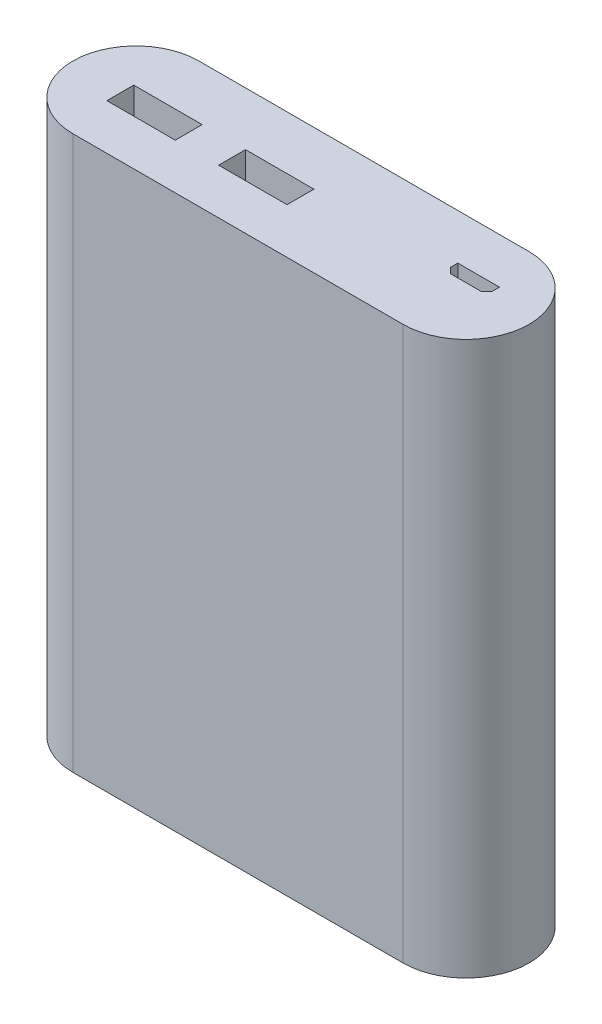
ISO-10303-21;
HEADER;
FILE_DESCRIPTION(('STEP AP214'),'2;1');
FILE_NAME('part.step','',(''),(''),'','','');
FILE_SCHEMA(('AUTOMOTIVE_DESIGN { 1 0 10303 214 1 1 1 1 }'));
ENDSEC;
DATA;
#1=APPLICATION_CONTEXT('core data for automotive mechanical design processes');
#2=APPLICATION_PROTOCOL_DEFINITION('international standard','automotive_design',2000,#1);
#3=PRODUCT_CONTEXT('',#1,'mechanical');
#4=PRODUCT('Part','Part','',(#3));
#5=PRODUCT_RELATED_PRODUCT_CATEGORY('part','',(#4));
#6=PRODUCT_DEFINITION_FORMATION('','',#4);
#7=PRODUCT_DEFINITION_CONTEXT('part definition',#1,'design');
#8=PRODUCT_DEFINITION('design','',#6,#7);
#9=PRODUCT_DEFINITION_SHAPE('','',#8);
#10=(LENGTH_UNIT() NAMED_UNIT(*) SI_UNIT(.MILLI.,.METRE.));
#11=(NAMED_UNIT(*) PLANE_ANGLE_UNIT() SI_UNIT($,.RADIAN.));
#12=(NAMED_UNIT(*) SI_UNIT($,.STERADIAN.) SOLID_ANGLE_UNIT());
#13=UNCERTAINTY_MEASURE_WITH_UNIT(LENGTH_MEASURE(1.E-05),#10,'distance_accuracy_value','');
#14=(GEOMETRIC_REPRESENTATION_CONTEXT(3) GLOBAL_UNCERTAINTY_ASSIGNED_CONTEXT((#13)) GLOBAL_UNIT_ASSIGNED_CONTEXT((#10,
#11,#12)) REPRESENTATION_CONTEXT('',''));
#15=CARTESIAN_POINT('',(0.,0.,0.));
#16=DIRECTION('',(0.,0.,1.));
#17=DIRECTION('',(1.,0.,0.));
#18=AXIS2_PLACEMENT_3D('',#15,#16,#17);
#19=CARTESIAN_POINT('',(-28.95,97.,0.));
#20=DIRECTION('',(0.,-1.,0.));
#21=DIRECTION('',(0.,0.,-1.));
#22=AXIS2_PLACEMENT_3D('',#19,#20,#21);
#23=CYLINDRICAL_SURFACE('',#22,11.05);
#24=CARTESIAN_POINT('',(-28.95,0.,0.));
#25=DIRECTION('',(0.,1.,0.));
#26=DIRECTION('',(0.,0.,1.));
#27=AXIS2_PLACEMENT_3D('',#24,#25,#26);
#28=CIRCLE('',#27,11.05);
#29=CARTESIAN_POINT('',(-28.95,0.,-11.05));
#30=VERTEX_POINT('',#29);
#31=CARTESIAN_POINT('',(-28.95,0.,11.05));
#32=VERTEX_POINT('',#31);
#33=EDGE_CURVE('E196',#30,#32,#28,.T.);
#34=ORIENTED_EDGE('',*,*,#33,.T.);
#35=DIRECTION('',(0.,-1.,0.));
#36=VECTOR('',#35,1.);
#37=CARTESIAN_POINT('',(-28.95,97.,11.05));
#38=LINE('',#37,#36);
#39=CARTESIAN_POINT('',(-28.95,97.,11.05));
#40=VERTEX_POINT('',#39);
#41=EDGE_CURVE('E11',#40,#32,#38,.T.);
#42=ORIENTED_EDGE('',*,*,#41,.F.);
#43=CARTESIAN_POINT('',(-28.95,97.,0.));
#44=DIRECTION('',(0.,1.,0.));
#45=DIRECTION('',(0.,0.,1.));
#46=AXIS2_PLACEMENT_3D('',#43,#44,#45);
#47=CIRCLE('',#46,11.05);
#48=CARTESIAN_POINT('',(-28.95,97.,-11.05));
#49=VERTEX_POINT('',#48);
#50=EDGE_CURVE('E277',#49,#40,#47,.T.);
#51=ORIENTED_EDGE('',*,*,#50,.F.);
#52=DIRECTION('',(0.,-1.,0.));
#53=VECTOR('',#52,1.);
#54=CARTESIAN_POINT('',(-28.95,97.,-11.05));
#55=LINE('',#54,#53);
#56=EDGE_CURVE('E287',#49,#30,#55,.T.);
#57=ORIENTED_EDGE('',*,*,#56,.T.);
#58=EDGE_LOOP('',(#34,#42,#51,#57));
#59=FACE_BOUND('',#58,.T.);
#60=ADVANCED_FACE('F36',(#59),#23,.T.);
#61=CARTESIAN_POINT('',(-28.95,97.,11.05));
#62=DIRECTION('',(0.,0.,-1.));
#63=DIRECTION('',(-1.,0.,0.));
#64=AXIS2_PLACEMENT_3D('',#61,#62,#63);
#65=PLANE('',#64);
#66=DIRECTION('',(1.,0.,0.));
#67=VECTOR('',#66,1.);
#68=CARTESIAN_POINT('',(-28.95,0.,11.05));
#69=LINE('',#68,#67);
#70=CARTESIAN_POINT('',(28.95,0.,11.05));
#71=VERTEX_POINT('',#70);
#72=EDGE_CURVE('E290',#32,#71,#69,.T.);
#73=ORIENTED_EDGE('',*,*,#72,.T.);
#74=DIRECTION('',(0.,-1.,0.));
#75=VECTOR('',#74,1.);
#76=CARTESIAN_POINT('',(28.95,97.,11.05));
#77=LINE('',#76,#75);
#78=CARTESIAN_POINT('',(28.95,97.,11.05));
#79=VERTEX_POINT('',#78);
#80=EDGE_CURVE('E43',#79,#71,#77,.T.);
#81=ORIENTED_EDGE('',*,*,#80,.F.);
#82=DIRECTION('',(1.,0.,0.));
#83=VECTOR('',#82,1.);
#84=CARTESIAN_POINT('',(-28.95,97.,11.05));
#85=LINE('',#84,#83);
#86=EDGE_CURVE('E280',#40,#79,#85,.T.);
#87=ORIENTED_EDGE('',*,*,#86,.F.);
#88=ORIENTED_EDGE('',*,*,#41,.T.);
#89=EDGE_LOOP('',(#73,#81,#87,#88));
#90=FACE_BOUND('',#89,.T.);
#91=ADVANCED_FACE('F320',(#90),#65,.F.);
#92=CARTESIAN_POINT('',(28.95,97.,0.));
#93=DIRECTION('',(0.,-1.,0.));
#94=DIRECTION('',(0.,0.,-1.));
#95=AXIS2_PLACEMENT_3D('',#92,#93,#94);
#96=CYLINDRICAL_SURFACE('',#95,11.05);
#97=CARTESIAN_POINT('',(28.95,0.,0.));
#98=DIRECTION('',(0.,1.,0.));
#99=DIRECTION('',(0.,0.,1.));
#100=AXIS2_PLACEMENT_3D('',#97,#98,#99);
#101=CIRCLE('',#100,11.05);
#102=CARTESIAN_POINT('',(28.95,0.,-11.05));
#103=VERTEX_POINT('',#102);
#104=EDGE_CURVE('E292',#71,#103,#101,.T.);
#105=ORIENTED_EDGE('',*,*,#104,.T.);
#106=DIRECTION('',(0.,-1.,0.));
#107=VECTOR('',#106,1.);
#108=CARTESIAN_POINT('',(28.95,97.,-11.05));
#109=LINE('',#108,#107);
#110=CARTESIAN_POINT('',(28.95,97.,-11.05));
#111=VERTEX_POINT('',#110);
#112=EDGE_CURVE('E297',#111,#103,#109,.T.);
#113=ORIENTED_EDGE('',*,*,#112,.F.);
#114=CARTESIAN_POINT('',(28.95,97.,0.));
#115=DIRECTION('',(0.,1.,0.));
#116=DIRECTION('',(0.,0.,1.));
#117=AXIS2_PLACEMENT_3D('',#114,#115,#116);
#118=CIRCLE('',#117,11.05);
#119=EDGE_CURVE('E283',#79,#111,#118,.T.);
#120=ORIENTED_EDGE('',*,*,#119,.F.);
#121=ORIENTED_EDGE('',*,*,#80,.T.);
#122=EDGE_LOOP('',(#105,#113,#120,#121));
#123=FACE_BOUND('',#122,.T.);
#124=ADVANCED_FACE('F304',(#123),#96,.T.);
#125=CARTESIAN_POINT('',(-28.95,97.,-11.05));
#126=DIRECTION('',(0.,0.,1.));
#127=DIRECTION('',(1.,0.,0.));
#128=AXIS2_PLACEMENT_3D('',#125,#126,#127);
#129=PLANE('',#128);
#130=DIRECTION('',(-1.,0.,0.));
#131=VECTOR('',#130,1.);
#132=CARTESIAN_POINT('',(-28.95,0.,-11.05));
#133=LINE('',#132,#131);
#134=EDGE_CURVE('E281',#103,#30,#133,.T.);
#135=ORIENTED_EDGE('',*,*,#134,.T.);
#136=ORIENTED_EDGE('',*,*,#56,.F.);
#137=DIRECTION('',(-1.,0.,0.));
#138=VECTOR('',#137,1.);
#139=CARTESIAN_POINT('',(-28.95,97.,-11.05));
#140=LINE('',#139,#138);
#141=EDGE_CURVE('E285',#111,#49,#140,.T.);
#142=ORIENTED_EDGE('',*,*,#141,.F.);
#143=ORIENTED_EDGE('',*,*,#112,.T.);
#144=EDGE_LOOP('',(#135,#136,#142,#143));
#145=FACE_BOUND('',#144,.T.);
#146=ADVANCED_FACE('F313',(#145),#129,.F.);
#147=CARTESIAN_POINT('',(-28.95,97.,0.));
#148=DIRECTION('',(0.,1.,0.));
#149=DIRECTION('',(0.,0.,1.));
#150=AXIS2_PLACEMENT_3D('',#147,#148,#149);
#151=PLANE('',#150);
#152=DIRECTION('',(0.,0.,-1.));
#153=VECTOR('',#152,1.);
#154=CARTESIAN_POINT('',(-19.,97.,-1.67));
#155=LINE('',#154,#153);
#156=CARTESIAN_POINT('',(-19.,97.,3.05));
#157=VERTEX_POINT('',#156);
#158=CARTESIAN_POINT('',(-19.,97.,-1.67));
#159=VERTEX_POINT('',#158);
#160=EDGE_CURVE('E50',#157,#159,#155,.T.);
#161=ORIENTED_EDGE('',*,*,#160,.F.);
#162=DIRECTION('',(1.,0.,0.));
#163=VECTOR('',#162,1.);
#164=CARTESIAN_POINT('',(-31.,97.,3.05));
#165=LINE('',#164,#163);
#166=CARTESIAN_POINT('',(-31.,97.,3.05));
#167=VERTEX_POINT('',#166);
#168=EDGE_CURVE('E180',#167,#157,#165,.T.);
#169=ORIENTED_EDGE('',*,*,#168,.F.);
#170=DIRECTION('',(0.,0.,1.));
#171=VECTOR('',#170,1.);
#172=CARTESIAN_POINT('',(-31.,97.,-1.67));
#173=LINE('',#172,#171);
#174=CARTESIAN_POINT('',(-31.,97.,-1.67));
#175=VERTEX_POINT('',#174);
#176=EDGE_CURVE('E183',#175,#167,#173,.T.);
#177=ORIENTED_EDGE('',*,*,#176,.F.);
#178=DIRECTION('',(-1.,0.,0.));
#179=VECTOR('',#178,1.);
#180=CARTESIAN_POINT('',(-31.,97.,-1.67));
#181=LINE('',#180,#179);
#182=EDGE_CURVE('E189',#159,#175,#181,.T.);
#183=ORIENTED_EDGE('',*,*,#182,.F.);
#184=EDGE_LOOP('',(#161,#169,#177,#183));
#185=FACE_BOUND('',#184,.T.);
#186=DIRECTION('',(1.,0.,0.));
#187=VECTOR('',#186,1.);
#188=CARTESIAN_POINT('',(-11.4,97.,3.05));
#189=LINE('',#188,#187);
#190=CARTESIAN_POINT('',(-11.4,97.,3.05));
#191=VERTEX_POINT('',#190);
#192=CARTESIAN_POINT('',(0.599999999999986,97.,3.05));
#193=VERTEX_POINT('',#192);
#194=EDGE_CURVE('E58',#191,#193,#189,.T.);
#195=ORIENTED_EDGE('',*,*,#194,.F.);
#196=DIRECTION('',(0.,0.,1.));
#197=VECTOR('',#196,1.);
#198=CARTESIAN_POINT('',(-11.4,97.,-1.67));
#199=LINE('',#198,#197);
#200=CARTESIAN_POINT('',(-11.4,97.,-1.67));
#201=VERTEX_POINT('',#200);
#202=EDGE_CURVE('E204',#201,#191,#199,.T.);
#203=ORIENTED_EDGE('',*,*,#202,.F.);
#204=DIRECTION('',(-1.,0.,0.));
#205=VECTOR('',#204,1.);
#206=CARTESIAN_POINT('',(-11.4,97.,-1.67));
#207=LINE('',#206,#205);
#208=CARTESIAN_POINT('',(0.599999999999986,97.,-1.67));
#209=VERTEX_POINT('',#208);
#210=EDGE_CURVE('E219',#209,#201,#207,.T.);
#211=ORIENTED_EDGE('',*,*,#210,.F.);
#212=DIRECTION('',(0.,0.,-1.));
#213=VECTOR('',#212,1.);
#214=CARTESIAN_POINT('',(0.599999999999986,97.,-1.67));
#215=LINE('',#214,#213);
#216=EDGE_CURVE('E215',#193,#209,#215,.T.);
#217=ORIENTED_EDGE('',*,*,#216,.F.);
#218=EDGE_LOOP('',(#195,#203,#211,#217));
#219=FACE_BOUND('',#218,.T.);
#220=DIRECTION('',(0.,0.,-1.));
#221=VECTOR('',#220,1.);
#222=CARTESIAN_POINT('',(31.75,97.,-3.05));
#223=LINE('',#222,#221);
#224=CARTESIAN_POINT('',(31.75,97.,-1.8));
#225=VERTEX_POINT('',#224);
#226=CARTESIAN_POINT('',(31.75,97.,-3.05));
#227=VERTEX_POINT('',#226);
#228=EDGE_CURVE('E250',#225,#227,#223,.T.);
#229=ORIENTED_EDGE('',*,*,#228,.F.);
#230=DIRECTION('',(0.707106781186548,0.,-0.707106781186547));
#231=VECTOR('',#230,1.);
#232=CARTESIAN_POINT('',(31.75,97.,-1.8));
#233=LINE('',#232,#231);
#234=CARTESIAN_POINT('',(30.75,97.,-0.8));
#235=VERTEX_POINT('',#234);
#236=EDGE_CURVE('E234',#235,#225,#233,.T.);
#237=ORIENTED_EDGE('',*,*,#236,.F.);
#238=DIRECTION('',(1.,0.,0.));
#239=VECTOR('',#238,1.);
#240=CARTESIAN_POINT('',(30.75,97.,-0.8));
#241=LINE('',#240,#239);
#242=CARTESIAN_POINT('',(25.45,97.,-0.8));
#243=VERTEX_POINT('',#242);
#244=EDGE_CURVE('E261',#243,#235,#241,.T.);
#245=ORIENTED_EDGE('',*,*,#244,.F.);
#246=DIRECTION('',(0.707106781186548,0.,0.707106781186547));
#247=VECTOR('',#246,1.);
#248=CARTESIAN_POINT('',(25.45,97.,-0.8));
#249=LINE('',#248,#247);
#250=CARTESIAN_POINT('',(24.45,97.,-1.8));
#251=VERTEX_POINT('',#250);
#252=EDGE_CURVE('E258',#251,#243,#249,.T.);
#253=ORIENTED_EDGE('',*,*,#252,.F.);
#254=DIRECTION('',(0.,0.,1.));
#255=VECTOR('',#254,1.);
#256=CARTESIAN_POINT('',(24.45,97.,-1.8));
#257=LINE('',#256,#255);
#258=CARTESIAN_POINT('',(24.45,97.,-3.05));
#259=VERTEX_POINT('',#258);
#260=EDGE_CURVE('E255',#259,#251,#257,.T.);
#261=ORIENTED_EDGE('',*,*,#260,.F.);
#262=DIRECTION('',(-1.,0.,0.));
#263=VECTOR('',#262,1.);
#264=CARTESIAN_POINT('',(24.45,97.,-3.05));
#265=LINE('',#264,#263);
#266=EDGE_CURVE('E252',#227,#259,#265,.T.);
#267=ORIENTED_EDGE('',*,*,#266,.F.);
#268=EDGE_LOOP('',(#229,#237,#245,#253,#261,#267));
#269=FACE_BOUND('',#268,.T.);
#270=ORIENTED_EDGE('',*,*,#50,.T.);
#271=ORIENTED_EDGE('',*,*,#86,.T.);
#272=ORIENTED_EDGE('',*,*,#119,.T.);
#273=ORIENTED_EDGE('',*,*,#141,.T.);
#274=EDGE_LOOP('',(#270,#271,#272,#273));
#275=FACE_BOUND('',#274,.T.);
#276=ADVANCED_FACE('F319',(#185,#219,#269,#275),#151,.T.);
#277=CARTESIAN_POINT('',(-28.95,0.,0.));
#278=DIRECTION('',(0.,1.,0.));
#279=DIRECTION('',(0.,0.,1.));
#280=AXIS2_PLACEMENT_3D('',#277,#278,#279);
#281=PLANE('',#280);
#282=ORIENTED_EDGE('',*,*,#33,.F.);
#283=ORIENTED_EDGE('',*,*,#134,.F.);
#284=ORIENTED_EDGE('',*,*,#104,.F.);
#285=ORIENTED_EDGE('',*,*,#72,.F.);
#286=EDGE_LOOP('',(#282,#283,#284,#285));
#287=FACE_BOUND('',#286,.T.);
#288=ADVANCED_FACE('F310',(#287),#281,.F.);
#289=CARTESIAN_POINT('',(31.75,87.,-3.05));
#290=DIRECTION('',(1.,0.,0.));
#291=DIRECTION('',(0.,0.,-1.));
#292=AXIS2_PLACEMENT_3D('',#289,#290,#291);
#293=PLANE('',#292);
#294=ORIENTED_EDGE('',*,*,#228,.T.);
#295=DIRECTION('',(0.,1.,0.));
#296=VECTOR('',#295,1.);
#297=CARTESIAN_POINT('',(31.75,87.,-3.05));
#298=LINE('',#297,#296);
#299=CARTESIAN_POINT('',(31.75,87.,-3.05));
#300=VERTEX_POINT('',#299);
#301=EDGE_CURVE('E249',#300,#227,#298,.T.);
#302=ORIENTED_EDGE('',*,*,#301,.F.);
#303=DIRECTION('',(0.,0.,-1.));
#304=VECTOR('',#303,1.);
#305=CARTESIAN_POINT('',(31.75,87.,-3.05));
#306=LINE('',#305,#304);
#307=CARTESIAN_POINT('',(31.75,87.,-1.8));
#308=VERTEX_POINT('',#307);
#309=EDGE_CURVE('E230',#308,#300,#306,.T.);
#310=ORIENTED_EDGE('',*,*,#309,.F.);
#311=DIRECTION('',(0.,1.,0.));
#312=VECTOR('',#311,1.);
#313=CARTESIAN_POINT('',(31.75,87.,-1.8));
#314=LINE('',#313,#312);
#315=EDGE_CURVE('E216',#308,#225,#314,.T.);
#316=ORIENTED_EDGE('',*,*,#315,.T.);
#317=EDGE_LOOP('',(#294,#302,#310,#316));
#318=FACE_BOUND('',#317,.T.);
#319=ADVANCED_FACE('F332',(#318),#293,.F.);
#320=CARTESIAN_POINT('',(31.75,87.,-1.8));
#321=DIRECTION('',(0.707106781186547,0.,0.707106781186548));
#322=DIRECTION('',(0.707106781186548,0.,-0.707106781186547));
#323=AXIS2_PLACEMENT_3D('',#320,#321,#322);
#324=PLANE('',#323);
#325=ORIENTED_EDGE('',*,*,#236,.T.);
#326=ORIENTED_EDGE('',*,*,#315,.F.);
#327=DIRECTION('',(0.707106781186548,0.,-0.707106781186547));
#328=VECTOR('',#327,1.);
#329=CARTESIAN_POINT('',(31.75,87.,-1.8));
#330=LINE('',#329,#328);
#331=CARTESIAN_POINT('',(30.75,87.,-0.8));
#332=VERTEX_POINT('',#331);
#333=EDGE_CURVE('E246',#332,#308,#330,.T.);
#334=ORIENTED_EDGE('',*,*,#333,.F.);
#335=DIRECTION('',(0.,1.,0.));
#336=VECTOR('',#335,1.);
#337=CARTESIAN_POINT('',(30.75,87.,-0.8));
#338=LINE('',#337,#336);
#339=EDGE_CURVE('E267',#332,#235,#338,.T.);
#340=ORIENTED_EDGE('',*,*,#339,.T.);
#341=EDGE_LOOP('',(#325,#326,#334,#340));
#342=FACE_BOUND('',#341,.T.);
#343=ADVANCED_FACE('F338',(#342),#324,.F.);
#344=CARTESIAN_POINT('',(30.75,87.,-0.8));
#345=DIRECTION('',(0.,0.,1.));
#346=DIRECTION('',(1.,0.,0.));
#347=AXIS2_PLACEMENT_3D('',#344,#345,#346);
#348=PLANE('',#347);
#349=ORIENTED_EDGE('',*,*,#244,.T.);
#350=ORIENTED_EDGE('',*,*,#339,.F.);
#351=DIRECTION('',(1.,0.,0.));
#352=VECTOR('',#351,1.);
#353=CARTESIAN_POINT('',(30.75,87.,-0.8));
#354=LINE('',#353,#352);
#355=CARTESIAN_POINT('',(25.45,87.,-0.8));
#356=VERTEX_POINT('',#355);
#357=EDGE_CURVE('E243',#356,#332,#354,.T.);
#358=ORIENTED_EDGE('',*,*,#357,.F.);
#359=DIRECTION('',(0.,1.,0.));
#360=VECTOR('',#359,1.);
#361=CARTESIAN_POINT('',(25.45,87.,-0.8));
#362=LINE('',#361,#360);
#363=EDGE_CURVE('E269',#356,#243,#362,.T.);
#364=ORIENTED_EDGE('',*,*,#363,.T.);
#365=EDGE_LOOP('',(#349,#350,#358,#364));
#366=FACE_BOUND('',#365,.T.);
#367=ADVANCED_FACE('F352',(#366),#348,.F.);
#368=CARTESIAN_POINT('',(25.45,87.,-0.8));
#369=DIRECTION('',(-0.707106781186547,0.,0.707106781186548));
#370=DIRECTION('',(0.707106781186548,0.,0.707106781186547));
#371=AXIS2_PLACEMENT_3D('',#368,#369,#370);
#372=PLANE('',#371);
#373=ORIENTED_EDGE('',*,*,#252,.T.);
#374=ORIENTED_EDGE('',*,*,#363,.F.);
#375=DIRECTION('',(0.707106781186548,0.,0.707106781186547));
#376=VECTOR('',#375,1.);
#377=CARTESIAN_POINT('',(25.45,87.,-0.8));
#378=LINE('',#377,#376);
#379=CARTESIAN_POINT('',(24.45,87.,-1.8));
#380=VERTEX_POINT('',#379);
#381=EDGE_CURVE('E240',#380,#356,#378,.T.);
#382=ORIENTED_EDGE('',*,*,#381,.F.);
#383=DIRECTION('',(0.,1.,0.));
#384=VECTOR('',#383,1.);
#385=CARTESIAN_POINT('',(24.45,87.,-1.8));
#386=LINE('',#385,#384);
#387=EDGE_CURVE('E271',#380,#251,#386,.T.);
#388=ORIENTED_EDGE('',*,*,#387,.T.);
#389=EDGE_LOOP('',(#373,#374,#382,#388));
#390=FACE_BOUND('',#389,.T.);
#391=ADVANCED_FACE('F348',(#390),#372,.F.);
#392=CARTESIAN_POINT('',(24.45,87.,-1.8));
#393=DIRECTION('',(-1.,0.,0.));
#394=DIRECTION('',(0.,0.,1.));
#395=AXIS2_PLACEMENT_3D('',#392,#393,#394);
#396=PLANE('',#395);
#397=ORIENTED_EDGE('',*,*,#260,.T.);
#398=ORIENTED_EDGE('',*,*,#387,.F.);
#399=DIRECTION('',(0.,0.,1.));
#400=VECTOR('',#399,1.);
#401=CARTESIAN_POINT('',(24.45,87.,-1.8));
#402=LINE('',#401,#400);
#403=CARTESIAN_POINT('',(24.45,87.,-3.05));
#404=VERTEX_POINT('',#403);
#405=EDGE_CURVE('E237',#404,#380,#402,.T.);
#406=ORIENTED_EDGE('',*,*,#405,.F.);
#407=DIRECTION('',(0.,1.,0.));
#408=VECTOR('',#407,1.);
#409=CARTESIAN_POINT('',(24.45,87.,-3.05));
#410=LINE('',#409,#408);
#411=EDGE_CURVE('E273',#404,#259,#410,.T.);
#412=ORIENTED_EDGE('',*,*,#411,.T.);
#413=EDGE_LOOP('',(#397,#398,#406,#412));
#414=FACE_BOUND('',#413,.T.);
#415=ADVANCED_FACE('F344',(#414),#396,.F.);
#416=CARTESIAN_POINT('',(24.45,87.,-3.05));
#417=DIRECTION('',(0.,0.,-1.));
#418=DIRECTION('',(-1.,0.,0.));
#419=AXIS2_PLACEMENT_3D('',#416,#417,#418);
#420=PLANE('',#419);
#421=ORIENTED_EDGE('',*,*,#266,.T.);
#422=ORIENTED_EDGE('',*,*,#411,.F.);
#423=DIRECTION('',(-1.,0.,0.));
#424=VECTOR('',#423,1.);
#425=CARTESIAN_POINT('',(24.45,87.,-3.05));
#426=LINE('',#425,#424);
#427=EDGE_CURVE('E233',#300,#404,#426,.T.);
#428=ORIENTED_EDGE('',*,*,#427,.F.);
#429=ORIENTED_EDGE('',*,*,#301,.T.);
#430=EDGE_LOOP('',(#421,#422,#428,#429));
#431=FACE_BOUND('',#430,.T.);
#432=ADVANCED_FACE('F340',(#431),#420,.F.);
#433=CARTESIAN_POINT('',(0.,87.,0.));
#434=DIRECTION('',(0.,-1.,0.));
#435=DIRECTION('',(0.,0.,-1.));
#436=AXIS2_PLACEMENT_3D('',#433,#434,#435);
#437=PLANE('',#436);
#438=ORIENTED_EDGE('',*,*,#309,.T.);
#439=ORIENTED_EDGE('',*,*,#427,.T.);
#440=ORIENTED_EDGE('',*,*,#405,.T.);
#441=ORIENTED_EDGE('',*,*,#381,.T.);
#442=ORIENTED_EDGE('',*,*,#357,.T.);
#443=ORIENTED_EDGE('',*,*,#333,.T.);
#444=EDGE_LOOP('',(#438,#439,#440,#441,#442,#443));
#445=FACE_BOUND('',#444,.T.);
#446=ADVANCED_FACE('F343',(#445),#437,.F.);
#447=CARTESIAN_POINT('',(-11.4,87.,3.05));
#448=DIRECTION('',(0.,0.,1.));
#449=DIRECTION('',(1.,0.,0.));
#450=AXIS2_PLACEMENT_3D('',#447,#448,#449);
#451=PLANE('',#450);
#452=ORIENTED_EDGE('',*,*,#194,.T.);
#453=DIRECTION('',(0.,1.,0.));
#454=VECTOR('',#453,1.);
#455=CARTESIAN_POINT('',(0.599999999999986,87.,3.05));
#456=LINE('',#455,#454);
#457=CARTESIAN_POINT('',(0.599999999999986,87.,3.05));
#458=VERTEX_POINT('',#457);
#459=EDGE_CURVE('E213',#458,#193,#456,.T.);
#460=ORIENTED_EDGE('',*,*,#459,.F.);
#461=DIRECTION('',(1.,0.,0.));
#462=VECTOR('',#461,1.);
#463=CARTESIAN_POINT('',(-11.4,87.,3.05));
#464=LINE('',#463,#462);
#465=CARTESIAN_POINT('',(-11.4,87.,3.05));
#466=VERTEX_POINT('',#465);
#467=EDGE_CURVE('E200',#466,#458,#464,.T.);
#468=ORIENTED_EDGE('',*,*,#467,.F.);
#469=DIRECTION('',(0.,1.,0.));
#470=VECTOR('',#469,1.);
#471=CARTESIAN_POINT('',(-11.4,87.,3.05));
#472=LINE('',#471,#470);
#473=EDGE_CURVE('E190',#466,#191,#472,.T.);
#474=ORIENTED_EDGE('',*,*,#473,.T.);
#475=EDGE_LOOP('',(#452,#460,#468,#474));
#476=FACE_BOUND('',#475,.T.);
#477=ADVANCED_FACE('F362',(#476),#451,.F.);
#478=CARTESIAN_POINT('',(-11.4,87.,-1.67));
#479=DIRECTION('',(-1.,0.,0.));
#480=DIRECTION('',(0.,0.,1.));
#481=AXIS2_PLACEMENT_3D('',#478,#479,#480);
#482=PLANE('',#481);
#483=ORIENTED_EDGE('',*,*,#202,.T.);
#484=ORIENTED_EDGE('',*,*,#473,.F.);
#485=DIRECTION('',(0.,0.,1.));
#486=VECTOR('',#485,1.);
#487=CARTESIAN_POINT('',(-11.4,87.,-1.67));
#488=LINE('',#487,#486);
#489=CARTESIAN_POINT('',(-11.4,87.,-1.67));
#490=VERTEX_POINT('',#489);
#491=EDGE_CURVE('E210',#490,#466,#488,.T.);
#492=ORIENTED_EDGE('',*,*,#491,.F.);
#493=DIRECTION('',(0.,1.,0.));
#494=VECTOR('',#493,1.);
#495=CARTESIAN_POINT('',(-11.4,87.,-1.67));
#496=LINE('',#495,#494);
#497=EDGE_CURVE('E225',#490,#201,#496,.T.);
#498=ORIENTED_EDGE('',*,*,#497,.T.);
#499=EDGE_LOOP('',(#483,#484,#492,#498));
#500=FACE_BOUND('',#499,.T.);
#501=ADVANCED_FACE('F366',(#500),#482,.F.);
#502=CARTESIAN_POINT('',(-11.4,87.,-1.67));
#503=DIRECTION('',(0.,0.,-1.));
#504=DIRECTION('',(-1.,0.,0.));
#505=AXIS2_PLACEMENT_3D('',#502,#503,#504);
#506=PLANE('',#505);
#507=ORIENTED_EDGE('',*,*,#210,.T.);
#508=ORIENTED_EDGE('',*,*,#497,.F.);
#509=DIRECTION('',(-1.,0.,0.));
#510=VECTOR('',#509,1.);
#511=CARTESIAN_POINT('',(-11.4,87.,-1.67));
#512=LINE('',#511,#510);
#513=CARTESIAN_POINT('',(0.599999999999986,87.,-1.67));
#514=VERTEX_POINT('',#513);
#515=EDGE_CURVE('E207',#514,#490,#512,.T.);
#516=ORIENTED_EDGE('',*,*,#515,.F.);
#517=DIRECTION('',(0.,1.,0.));
#518=VECTOR('',#517,1.);
#519=CARTESIAN_POINT('',(0.599999999999986,87.,-1.67));
#520=LINE('',#519,#518);
#521=EDGE_CURVE('E227',#514,#209,#520,.T.);
#522=ORIENTED_EDGE('',*,*,#521,.T.);
#523=EDGE_LOOP('',(#507,#508,#516,#522));
#524=FACE_BOUND('',#523,.T.);
#525=ADVANCED_FACE('F371',(#524),#506,.F.);
#526=CARTESIAN_POINT('',(0.599999999999986,87.,-1.67));
#527=DIRECTION('',(1.,0.,0.));
#528=DIRECTION('',(0.,0.,-1.));
#529=AXIS2_PLACEMENT_3D('',#526,#527,#528);
#530=PLANE('',#529);
#531=ORIENTED_EDGE('',*,*,#216,.T.);
#532=ORIENTED_EDGE('',*,*,#521,.F.);
#533=DIRECTION('',(0.,0.,-1.));
#534=VECTOR('',#533,1.);
#535=CARTESIAN_POINT('',(0.599999999999986,87.,-1.67));
#536=LINE('',#535,#534);
#537=EDGE_CURVE('E203',#458,#514,#536,.T.);
#538=ORIENTED_EDGE('',*,*,#537,.F.);
#539=ORIENTED_EDGE('',*,*,#459,.T.);
#540=EDGE_LOOP('',(#531,#532,#538,#539));
#541=FACE_BOUND('',#540,.T.);
#542=ADVANCED_FACE('F367',(#541),#530,.F.);
#543=CARTESIAN_POINT('',(0.,87.,0.));
#544=DIRECTION('',(0.,-1.,0.));
#545=DIRECTION('',(0.,0.,-1.));
#546=AXIS2_PLACEMENT_3D('',#543,#544,#545);
#547=PLANE('',#546);
#548=ORIENTED_EDGE('',*,*,#467,.T.);
#549=ORIENTED_EDGE('',*,*,#537,.T.);
#550=ORIENTED_EDGE('',*,*,#515,.T.);
#551=ORIENTED_EDGE('',*,*,#491,.T.);
#552=EDGE_LOOP('',(#548,#549,#550,#551));
#553=FACE_BOUND('',#552,.T.);
#554=ADVANCED_FACE('F370',(#553),#547,.F.);
#555=CARTESIAN_POINT('',(-19.,87.,-1.67));
#556=DIRECTION('',(1.,0.,0.));
#557=DIRECTION('',(0.,0.,-1.));
#558=AXIS2_PLACEMENT_3D('',#555,#556,#557);
#559=PLANE('',#558);
#560=ORIENTED_EDGE('',*,*,#160,.T.);
#561=DIRECTION('',(0.,1.,0.));
#562=VECTOR('',#561,1.);
#563=CARTESIAN_POINT('',(-19.,87.,-1.67));
#564=LINE('',#563,#562);
#565=CARTESIAN_POINT('',(-19.,87.,-1.67));
#566=VERTEX_POINT('',#565);
#567=EDGE_CURVE('E158',#566,#159,#564,.T.);
#568=ORIENTED_EDGE('',*,*,#567,.F.);
#569=DIRECTION('',(0.,0.,-1.));
#570=VECTOR('',#569,1.);
#571=CARTESIAN_POINT('',(-19.,87.,-1.67));
#572=LINE('',#571,#570);
#573=CARTESIAN_POINT('',(-19.,87.,3.05));
#574=VERTEX_POINT('',#573);
#575=EDGE_CURVE('E162',#574,#566,#572,.T.);
#576=ORIENTED_EDGE('',*,*,#575,.F.);
#577=DIRECTION('',(0.,1.,0.));
#578=VECTOR('',#577,1.);
#579=CARTESIAN_POINT('',(-19.,87.,3.05));
#580=LINE('',#579,#578);
#581=EDGE_CURVE('E194',#574,#157,#580,.T.);
#582=ORIENTED_EDGE('',*,*,#581,.T.);
#583=EDGE_LOOP('',(#560,#568,#576,#582));
#584=FACE_BOUND('',#583,.T.);
#585=ADVANCED_FACE('F160',(#584),#559,.F.);
#586=CARTESIAN_POINT('',(-31.,87.,3.05));
#587=DIRECTION('',(0.,0.,1.));
#588=DIRECTION('',(1.,0.,0.));
#589=AXIS2_PLACEMENT_3D('',#586,#587,#588);
#590=PLANE('',#589);
#591=ORIENTED_EDGE('',*,*,#168,.T.);
#592=ORIENTED_EDGE('',*,*,#581,.F.);
#593=DIRECTION('',(1.,0.,0.));
#594=VECTOR('',#593,1.);
#595=CARTESIAN_POINT('',(-31.,87.,3.05));
#596=LINE('',#595,#594);
#597=CARTESIAN_POINT('',(-31.,87.,3.05));
#598=VERTEX_POINT('',#597);
#599=EDGE_CURVE('E168',#598,#574,#596,.T.);
#600=ORIENTED_EDGE('',*,*,#599,.F.);
#601=DIRECTION('',(0.,1.,0.));
#602=VECTOR('',#601,1.);
#603=CARTESIAN_POINT('',(-31.,87.,3.05));
#604=LINE('',#603,#602);
#605=EDGE_CURVE('E197',#598,#167,#604,.T.);
#606=ORIENTED_EDGE('',*,*,#605,.T.);
#607=EDGE_LOOP('',(#591,#592,#600,#606));
#608=FACE_BOUND('',#607,.T.);
#609=ADVANCED_FACE('F384',(#608),#590,.F.);
#610=CARTESIAN_POINT('',(-31.,87.,-1.67));
#611=DIRECTION('',(-1.,0.,0.));
#612=DIRECTION('',(0.,0.,1.));
#613=AXIS2_PLACEMENT_3D('',#610,#611,#612);
#614=PLANE('',#613);
#615=ORIENTED_EDGE('',*,*,#176,.T.);
#616=ORIENTED_EDGE('',*,*,#605,.F.);
#617=DIRECTION('',(0.,0.,1.));
#618=VECTOR('',#617,1.);
#619=CARTESIAN_POINT('',(-31.,87.,-1.67));
#620=LINE('',#619,#618);
#621=CARTESIAN_POINT('',(-31.,87.,-1.67));
#622=VERTEX_POINT('',#621);
#623=EDGE_CURVE('E176',#622,#598,#620,.T.);
#624=ORIENTED_EDGE('',*,*,#623,.F.);
#625=DIRECTION('',(0.,1.,0.));
#626=VECTOR('',#625,1.);
#627=CARTESIAN_POINT('',(-31.,87.,-1.67));
#628=LINE('',#627,#626);
#629=EDGE_CURVE('E167',#622,#175,#628,.T.);
#630=ORIENTED_EDGE('',*,*,#629,.T.);
#631=EDGE_LOOP('',(#615,#616,#624,#630));
#632=FACE_BOUND('',#631,.T.);
#633=ADVANCED_FACE('F387',(#632),#614,.F.);
#634=CARTESIAN_POINT('',(-31.,87.,-1.67));
#635=DIRECTION('',(0.,0.,-1.));
#636=DIRECTION('',(-1.,0.,0.));
#637=AXIS2_PLACEMENT_3D('',#634,#635,#636);
#638=PLANE('',#637);
#639=ORIENTED_EDGE('',*,*,#182,.T.);
#640=ORIENTED_EDGE('',*,*,#629,.F.);
#641=DIRECTION('',(-1.,0.,0.));
#642=VECTOR('',#641,1.);
#643=CARTESIAN_POINT('',(-31.,87.,-1.67));
#644=LINE('',#643,#642);
#645=EDGE_CURVE('E171',#566,#622,#644,.T.);
#646=ORIENTED_EDGE('',*,*,#645,.F.);
#647=ORIENTED_EDGE('',*,*,#567,.T.);
#648=EDGE_LOOP('',(#639,#640,#646,#647));
#649=FACE_BOUND('',#648,.T.);
#650=ADVANCED_FACE('F172',(#649),#638,.F.);
#651=CARTESIAN_POINT('',(0.,87.,0.));
#652=DIRECTION('',(0.,1.,0.));
#653=DIRECTION('',(0.,0.,1.));
#654=AXIS2_PLACEMENT_3D('',#651,#652,#653);
#655=PLANE('',#654);
#656=ORIENTED_EDGE('',*,*,#575,.T.);
#657=ORIENTED_EDGE('',*,*,#645,.T.);
#658=ORIENTED_EDGE('',*,*,#623,.T.);
#659=ORIENTED_EDGE('',*,*,#599,.T.);
#660=EDGE_LOOP('',(#656,#657,#658,#659));
#661=FACE_BOUND('',#660,.T.);
#662=ADVANCED_FACE('F178',(#661),#655,.T.);
#663=CLOSED_SHELL('',(#60,#91,#124,#146,#276,#288,#319,#343,#367,#391,#415,#432,#446,#477,#501,
#525,#542,#554,#585,#609,#633,#650,#662));
#664=MANIFOLD_SOLID_BREP('B2',#663);
#665=ADVANCED_BREP_SHAPE_REPRESENTATION('',(#18,#664),#14);
#666=SHAPE_DEFINITION_REPRESENTATION(#9,#665);
ENDSEC;
END-ISO-10303-21;
